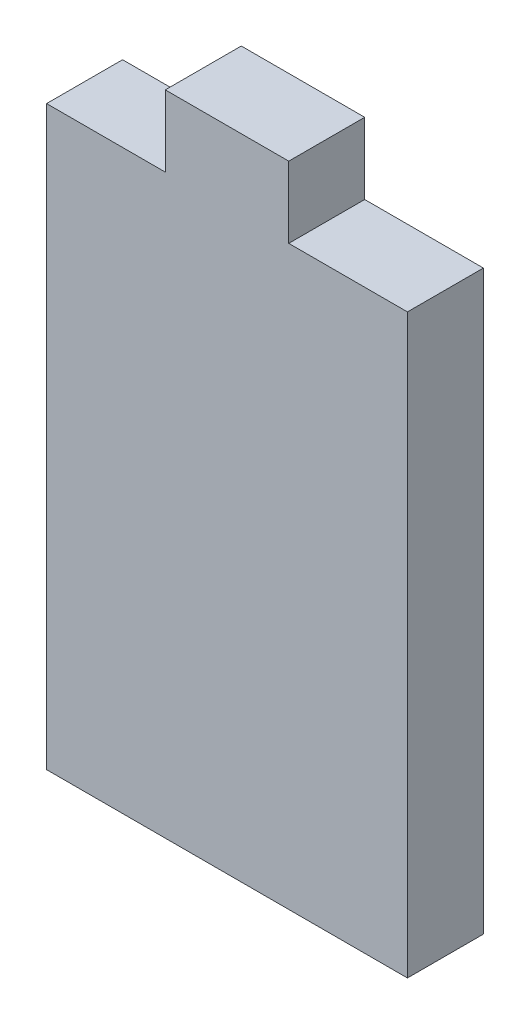
ISO-10303-21;
HEADER;
FILE_DESCRIPTION(('STEP AP214'),'2;1');
FILE_NAME('part.step','',(''),(''),'','','');
FILE_SCHEMA(('AUTOMOTIVE_DESIGN { 1 0 10303 214 1 1 1 1 }'));
ENDSEC;
DATA;
#1=APPLICATION_CONTEXT('core data for automotive mechanical design processes');
#2=APPLICATION_PROTOCOL_DEFINITION('international standard','automotive_design',2000,#1);
#3=PRODUCT_CONTEXT('',#1,'mechanical');
#4=PRODUCT('Part','Part','',(#3));
#5=PRODUCT_RELATED_PRODUCT_CATEGORY('part','',(#4));
#6=PRODUCT_DEFINITION_FORMATION('','',#4);
#7=PRODUCT_DEFINITION_CONTEXT('part definition',#1,'design');
#8=PRODUCT_DEFINITION('design','',#6,#7);
#9=PRODUCT_DEFINITION_SHAPE('','',#8);
#10=(LENGTH_UNIT() NAMED_UNIT(*) SI_UNIT(.MILLI.,.METRE.));
#11=(NAMED_UNIT(*) PLANE_ANGLE_UNIT() SI_UNIT($,.RADIAN.));
#12=(NAMED_UNIT(*) SI_UNIT($,.STERADIAN.) SOLID_ANGLE_UNIT());
#13=UNCERTAINTY_MEASURE_WITH_UNIT(LENGTH_MEASURE(1.E-05),#10,'distance_accuracy_value','');
#14=(GEOMETRIC_REPRESENTATION_CONTEXT(3) GLOBAL_UNCERTAINTY_ASSIGNED_CONTEXT((#13)) GLOBAL_UNIT_ASSIGNED_CONTEXT((#10,
#11,#12)) REPRESENTATION_CONTEXT('',''));
#15=CARTESIAN_POINT('',(0.,0.,0.));
#16=DIRECTION('',(0.,0.,1.));
#17=DIRECTION('',(1.,0.,0.));
#18=AXIS2_PLACEMENT_3D('',#15,#16,#17);
#19=CARTESIAN_POINT('',(0.,61.722,0.));
#20=DIRECTION('',(0.,1.,0.));
#21=DIRECTION('',(0.,0.,1.));
#22=AXIS2_PLACEMENT_3D('',#19,#20,#21);
#23=PLANE('',#22);
#24=DIRECTION('',(0.,0.,1.));
#25=VECTOR('',#24,1.);
#26=CARTESIAN_POINT('',(-6.604,61.722,-4.064));
#27=LINE('',#26,#25);
#28=CARTESIAN_POINT('',(-6.604,61.722,-4.064));
#29=VERTEX_POINT('',#28);
#30=CARTESIAN_POINT('',(-6.604,61.722,4.064));
#31=VERTEX_POINT('',#30);
#32=EDGE_CURVE('E51',#29,#31,#27,.T.);
#33=ORIENTED_EDGE('',*,*,#32,.F.);
#34=DIRECTION('',(-1.,0.,0.));
#35=VECTOR('',#34,1.);
#36=CARTESIAN_POINT('',(19.304,61.722,-4.064));
#37=LINE('',#36,#35);
#38=CARTESIAN_POINT('',(-19.304,61.722,-4.064));
#39=VERTEX_POINT('',#38);
#40=EDGE_CURVE('E140',#29,#39,#37,.T.);
#41=ORIENTED_EDGE('',*,*,#40,.T.);
#42=DIRECTION('',(0.,0.,1.));
#43=VECTOR('',#42,1.);
#44=CARTESIAN_POINT('',(-19.304,61.722,4.064));
#45=LINE('',#44,#43);
#46=CARTESIAN_POINT('',(-19.304,61.722,4.064));
#47=VERTEX_POINT('',#46);
#48=EDGE_CURVE('E131',#39,#47,#45,.T.);
#49=ORIENTED_EDGE('',*,*,#48,.T.);
#50=DIRECTION('',(1.,0.,0.));
#51=VECTOR('',#50,1.);
#52=CARTESIAN_POINT('',(19.304,61.722,4.064));
#53=LINE('',#52,#51);
#54=EDGE_CURVE('E136',#47,#31,#53,.T.);
#55=ORIENTED_EDGE('',*,*,#54,.T.);
#56=EDGE_LOOP('',(#33,#41,#49,#55));
#57=FACE_BOUND('',#56,.T.);
#58=ADVANCED_FACE('F36',(#57),#23,.T.);
#59=CARTESIAN_POINT('',(-19.304,61.722,4.064));
#60=DIRECTION('',(1.,0.,0.));
#61=DIRECTION('',(0.,0.,-1.));
#62=AXIS2_PLACEMENT_3D('',#59,#60,#61);
#63=PLANE('',#62);
#64=DIRECTION('',(0.,0.,1.));
#65=VECTOR('',#64,1.);
#66=CARTESIAN_POINT('',(-19.304,0.,4.064));
#67=LINE('',#66,#65);
#68=CARTESIAN_POINT('',(-19.304,0.,-4.064));
#69=VERTEX_POINT('',#68);
#70=CARTESIAN_POINT('',(-19.304,0.,4.064));
#71=VERTEX_POINT('',#70);
#72=EDGE_CURVE('E122',#69,#71,#67,.T.);
#73=ORIENTED_EDGE('',*,*,#72,.T.);
#74=DIRECTION('',(0.,-1.,0.));
#75=VECTOR('',#74,1.);
#76=CARTESIAN_POINT('',(-19.304,61.722,4.064));
#77=LINE('',#76,#75);
#78=EDGE_CURVE('E11',#47,#71,#77,.T.);
#79=ORIENTED_EDGE('',*,*,#78,.F.);
#80=ORIENTED_EDGE('',*,*,#48,.F.);
#81=DIRECTION('',(0.,-1.,0.));
#82=VECTOR('',#81,1.);
#83=CARTESIAN_POINT('',(-19.304,61.722,-4.064));
#84=LINE('',#83,#82);
#85=EDGE_CURVE('E142',#39,#69,#84,.T.);
#86=ORIENTED_EDGE('',*,*,#85,.T.);
#87=EDGE_LOOP('',(#73,#79,#80,#86));
#88=FACE_BOUND('',#87,.T.);
#89=ADVANCED_FACE('F38',(#88),#63,.F.);
#90=CARTESIAN_POINT('',(19.304,61.722,4.064));
#91=DIRECTION('',(0.,0.,-1.));
#92=DIRECTION('',(-1.,0.,0.));
#93=AXIS2_PLACEMENT_3D('',#90,#91,#92);
#94=PLANE('',#93);
#95=DIRECTION('',(1.,0.,0.));
#96=VECTOR('',#95,1.);
#97=CARTESIAN_POINT('',(19.304,0.,4.064));
#98=LINE('',#97,#96);
#99=CARTESIAN_POINT('',(19.304,0.,4.064));
#100=VERTEX_POINT('',#99);
#101=EDGE_CURVE('E125',#71,#100,#98,.T.);
#102=ORIENTED_EDGE('',*,*,#101,.T.);
#103=DIRECTION('',(0.,-1.,0.));
#104=VECTOR('',#103,1.);
#105=CARTESIAN_POINT('',(19.304,61.722,4.064));
#106=LINE('',#105,#104);
#107=CARTESIAN_POINT('',(19.304,61.722,4.064));
#108=VERTEX_POINT('',#107);
#109=EDGE_CURVE('E44',#108,#100,#106,.T.);
#110=ORIENTED_EDGE('',*,*,#109,.F.);
#111=CARTESIAN_POINT('',(6.604,61.722,4.064));
#112=VERTEX_POINT('',#111);
#113=EDGE_CURVE('E134',#112,#108,#53,.T.);
#114=ORIENTED_EDGE('',*,*,#113,.F.);
#115=DIRECTION('',(0.,-1.,0.));
#116=VECTOR('',#115,1.);
#117=CARTESIAN_POINT('',(6.604,69.342,4.064));
#118=LINE('',#117,#116);
#119=CARTESIAN_POINT('',(6.604,69.342,4.064));
#120=VERTEX_POINT('',#119);
#121=EDGE_CURVE('E107',#120,#112,#118,.T.);
#122=ORIENTED_EDGE('',*,*,#121,.F.);
#123=DIRECTION('',(1.,0.,0.));
#124=VECTOR('',#123,1.);
#125=CARTESIAN_POINT('',(-6.60399999999999,69.342,4.064));
#126=LINE('',#125,#124);
#127=CARTESIAN_POINT('',(-6.60399999999999,69.342,4.064));
#128=VERTEX_POINT('',#127);
#129=EDGE_CURVE('E101',#128,#120,#126,.T.);
#130=ORIENTED_EDGE('',*,*,#129,.F.);
#131=DIRECTION('',(0.,-1.,0.));
#132=VECTOR('',#131,1.);
#133=CARTESIAN_POINT('',(-6.60399999999999,69.342,4.064));
#134=LINE('',#133,#132);
#135=EDGE_CURVE('E105',#128,#31,#134,.T.);
#136=ORIENTED_EDGE('',*,*,#135,.T.);
#137=ORIENTED_EDGE('',*,*,#54,.F.);
#138=ORIENTED_EDGE('',*,*,#78,.T.);
#139=EDGE_LOOP('',(#102,#110,#114,#122,#130,#136,#137,#138));
#140=FACE_BOUND('',#139,.T.);
#141=ADVANCED_FACE('F103',(#140),#94,.F.);
#142=CARTESIAN_POINT('',(19.304,61.722,4.064));
#143=DIRECTION('',(-1.,0.,0.));
#144=DIRECTION('',(0.,0.,1.));
#145=AXIS2_PLACEMENT_3D('',#142,#143,#144);
#146=PLANE('',#145);
#147=DIRECTION('',(0.,0.,-1.));
#148=VECTOR('',#147,1.);
#149=CARTESIAN_POINT('',(19.304,0.,4.064));
#150=LINE('',#149,#148);
#151=CARTESIAN_POINT('',(19.304,0.,-4.064));
#152=VERTEX_POINT('',#151);
#153=EDGE_CURVE('E145',#100,#152,#150,.T.);
#154=ORIENTED_EDGE('',*,*,#153,.T.);
#155=DIRECTION('',(0.,-1.,0.));
#156=VECTOR('',#155,1.);
#157=CARTESIAN_POINT('',(19.304,61.722,-4.064));
#158=LINE('',#157,#156);
#159=CARTESIAN_POINT('',(19.304,61.722,-4.064));
#160=VERTEX_POINT('',#159);
#161=EDGE_CURVE('E150',#160,#152,#158,.T.);
#162=ORIENTED_EDGE('',*,*,#161,.F.);
#163=DIRECTION('',(0.,0.,-1.));
#164=VECTOR('',#163,1.);
#165=CARTESIAN_POINT('',(19.304,61.722,4.064));
#166=LINE('',#165,#164);
#167=EDGE_CURVE('E138',#108,#160,#166,.T.);
#168=ORIENTED_EDGE('',*,*,#167,.F.);
#169=ORIENTED_EDGE('',*,*,#109,.T.);
#170=EDGE_LOOP('',(#154,#162,#168,#169));
#171=FACE_BOUND('',#170,.T.);
#172=ADVANCED_FACE('F157',(#171),#146,.F.);
#173=CARTESIAN_POINT('',(19.304,61.722,-4.064));
#174=DIRECTION('',(0.,0.,1.));
#175=DIRECTION('',(1.,0.,0.));
#176=AXIS2_PLACEMENT_3D('',#173,#174,#175);
#177=PLANE('',#176);
#178=DIRECTION('',(-1.,0.,0.));
#179=VECTOR('',#178,1.);
#180=CARTESIAN_POINT('',(19.304,0.,-4.064));
#181=LINE('',#180,#179);
#182=EDGE_CURVE('E135',#152,#69,#181,.T.);
#183=ORIENTED_EDGE('',*,*,#182,.T.);
#184=ORIENTED_EDGE('',*,*,#85,.F.);
#185=ORIENTED_EDGE('',*,*,#40,.F.);
#186=DIRECTION('',(0.,-1.,0.));
#187=VECTOR('',#186,1.);
#188=CARTESIAN_POINT('',(-6.604,69.342,-4.064));
#189=LINE('',#188,#187);
#190=CARTESIAN_POINT('',(-6.604,69.342,-4.064));
#191=VERTEX_POINT('',#190);
#192=EDGE_CURVE('E170',#191,#29,#189,.T.);
#193=ORIENTED_EDGE('',*,*,#192,.F.);
#194=DIRECTION('',(-1.,0.,0.));
#195=VECTOR('',#194,1.);
#196=CARTESIAN_POINT('',(-6.604,69.342,-4.064));
#197=LINE('',#196,#195);
#198=CARTESIAN_POINT('',(6.604,69.342,-4.064));
#199=VERTEX_POINT('',#198);
#200=EDGE_CURVE('E116',#199,#191,#197,.T.);
#201=ORIENTED_EDGE('',*,*,#200,.F.);
#202=DIRECTION('',(0.,-1.,0.));
#203=VECTOR('',#202,1.);
#204=CARTESIAN_POINT('',(6.604,69.342,-4.064));
#205=LINE('',#204,#203);
#206=CARTESIAN_POINT('',(6.604,61.722,-4.064));
#207=VERTEX_POINT('',#206);
#208=EDGE_CURVE('E127',#199,#207,#205,.T.);
#209=ORIENTED_EDGE('',*,*,#208,.T.);
#210=EDGE_CURVE('E141',#160,#207,#37,.T.);
#211=ORIENTED_EDGE('',*,*,#210,.F.);
#212=ORIENTED_EDGE('',*,*,#161,.T.);
#213=EDGE_LOOP('',(#183,#184,#185,#193,#201,#209,#211,#212));
#214=FACE_BOUND('',#213,.T.);
#215=ADVANCED_FACE('F165',(#214),#177,.F.);
#216=DIRECTION('',(0.,0.,-1.));
#217=VECTOR('',#216,1.);
#218=CARTESIAN_POINT('',(6.604,61.722,-4.064));
#219=LINE('',#218,#217);
#220=EDGE_CURVE('E59',#112,#207,#219,.T.);
#221=ORIENTED_EDGE('',*,*,#220,.F.);
#222=ORIENTED_EDGE('',*,*,#113,.T.);
#223=ORIENTED_EDGE('',*,*,#167,.T.);
#224=ORIENTED_EDGE('',*,*,#210,.T.);
#225=EDGE_LOOP('',(#221,#222,#223,#224));
#226=FACE_BOUND('',#225,.T.);
#227=ADVANCED_FACE('F180',(#226),#23,.T.);
#228=CARTESIAN_POINT('',(0.,0.,0.));
#229=DIRECTION('',(0.,1.,0.));
#230=DIRECTION('',(0.,0.,1.));
#231=AXIS2_PLACEMENT_3D('',#228,#229,#230);
#232=PLANE('',#231);
#233=ORIENTED_EDGE('',*,*,#72,.F.);
#234=ORIENTED_EDGE('',*,*,#182,.F.);
#235=ORIENTED_EDGE('',*,*,#153,.F.);
#236=ORIENTED_EDGE('',*,*,#101,.F.);
#237=EDGE_LOOP('',(#233,#234,#235,#236));
#238=FACE_BOUND('',#237,.T.);
#239=ADVANCED_FACE('F162',(#238),#232,.F.);
#240=CARTESIAN_POINT('',(-6.604,69.342,-4.064));
#241=DIRECTION('',(1.,0.,0.));
#242=DIRECTION('',(0.,0.,-1.));
#243=AXIS2_PLACEMENT_3D('',#240,#241,#242);
#244=PLANE('',#243);
#245=ORIENTED_EDGE('',*,*,#32,.T.);
#246=ORIENTED_EDGE('',*,*,#135,.F.);
#247=DIRECTION('',(0.,0.,1.));
#248=VECTOR('',#247,1.);
#249=CARTESIAN_POINT('',(-6.604,69.342,-4.064));
#250=LINE('',#249,#248);
#251=EDGE_CURVE('E111',#191,#128,#250,.T.);
#252=ORIENTED_EDGE('',*,*,#251,.F.);
#253=ORIENTED_EDGE('',*,*,#192,.T.);
#254=EDGE_LOOP('',(#245,#246,#252,#253));
#255=FACE_BOUND('',#254,.T.);
#256=ADVANCED_FACE('F121',(#255),#244,.F.);
#257=CARTESIAN_POINT('',(6.604,69.342,-4.064));
#258=DIRECTION('',(-1.,0.,0.));
#259=DIRECTION('',(0.,0.,1.));
#260=AXIS2_PLACEMENT_3D('',#257,#258,#259);
#261=PLANE('',#260);
#262=ORIENTED_EDGE('',*,*,#220,.T.);
#263=ORIENTED_EDGE('',*,*,#208,.F.);
#264=DIRECTION('',(0.,0.,-1.));
#265=VECTOR('',#264,1.);
#266=CARTESIAN_POINT('',(6.604,69.342,-4.064));
#267=LINE('',#266,#265);
#268=EDGE_CURVE('E110',#120,#199,#267,.T.);
#269=ORIENTED_EDGE('',*,*,#268,.F.);
#270=ORIENTED_EDGE('',*,*,#121,.T.);
#271=EDGE_LOOP('',(#262,#263,#269,#270));
#272=FACE_BOUND('',#271,.T.);
#273=ADVANCED_FACE('F179',(#272),#261,.F.);
#274=CARTESIAN_POINT('',(0.,69.342,0.));
#275=DIRECTION('',(0.,1.,0.));
#276=DIRECTION('',(0.,0.,1.));
#277=AXIS2_PLACEMENT_3D('',#274,#275,#276);
#278=PLANE('',#277);
#279=ORIENTED_EDGE('',*,*,#251,.T.);
#280=ORIENTED_EDGE('',*,*,#129,.T.);
#281=ORIENTED_EDGE('',*,*,#268,.T.);
#282=ORIENTED_EDGE('',*,*,#200,.T.);
#283=EDGE_LOOP('',(#279,#280,#281,#282));
#284=FACE_BOUND('',#283,.T.);
#285=ADVANCED_FACE('F114',(#284),#278,.T.);
#286=CLOSED_SHELL('',(#58,#89,#141,#172,#215,#227,#239,#256,#273,#285));
#287=MANIFOLD_SOLID_BREP('B2',#286);
#288=ADVANCED_BREP_SHAPE_REPRESENTATION('',(#18,#287),#14);
#289=SHAPE_DEFINITION_REPRESENTATION(#9,#288);
ENDSEC;
END-ISO-10303-21;
